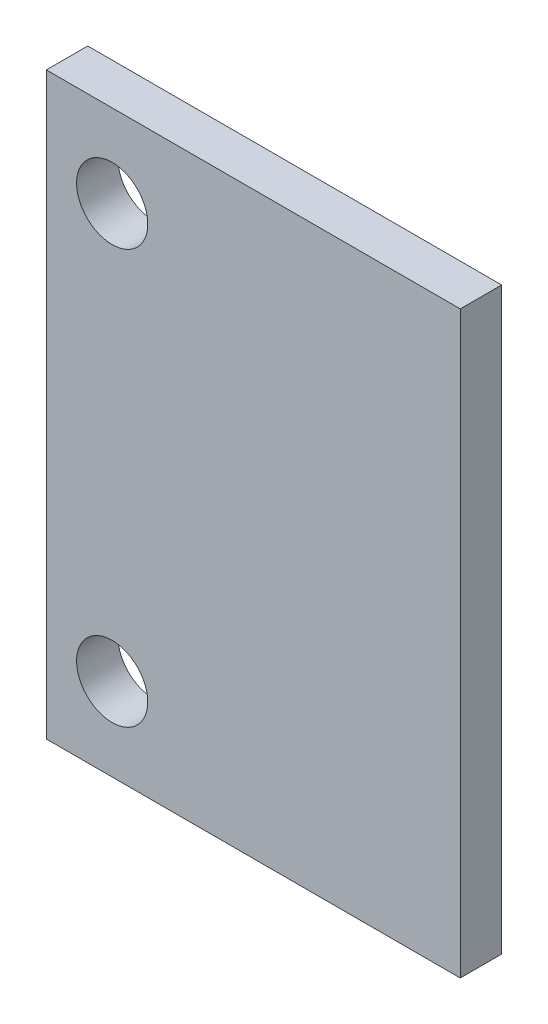
ISO-10303-21;
HEADER;
FILE_DESCRIPTION(('STEP AP214'),'2;1');
FILE_NAME('part.step','',(''),(''),'','','');
FILE_SCHEMA(('AUTOMOTIVE_DESIGN { 1 0 10303 214 1 1 1 1 }'));
ENDSEC;
DATA;
#1=APPLICATION_CONTEXT('core data for automotive mechanical design processes');
#2=APPLICATION_PROTOCOL_DEFINITION('international standard','automotive_design',2000,#1);
#3=PRODUCT_CONTEXT('',#1,'mechanical');
#4=PRODUCT('Part','Part','',(#3));
#5=PRODUCT_RELATED_PRODUCT_CATEGORY('part','',(#4));
#6=PRODUCT_DEFINITION_FORMATION('','',#4);
#7=PRODUCT_DEFINITION_CONTEXT('part definition',#1,'design');
#8=PRODUCT_DEFINITION('design','',#6,#7);
#9=PRODUCT_DEFINITION_SHAPE('','',#8);
#10=(LENGTH_UNIT() NAMED_UNIT(*) SI_UNIT(.MILLI.,.METRE.));
#11=(NAMED_UNIT(*) PLANE_ANGLE_UNIT() SI_UNIT($,.RADIAN.));
#12=(NAMED_UNIT(*) SI_UNIT($,.STERADIAN.) SOLID_ANGLE_UNIT());
#13=UNCERTAINTY_MEASURE_WITH_UNIT(LENGTH_MEASURE(1.E-05),#10,'distance_accuracy_value','');
#14=(GEOMETRIC_REPRESENTATION_CONTEXT(3) GLOBAL_UNCERTAINTY_ASSIGNED_CONTEXT((#13)) GLOBAL_UNIT_ASSIGNED_CONTEXT((#10,
#11,#12)) REPRESENTATION_CONTEXT('',''));
#15=CARTESIAN_POINT('',(0.,0.,0.));
#16=DIRECTION('',(0.,0.,1.));
#17=DIRECTION('',(1.,0.,0.));
#18=AXIS2_PLACEMENT_3D('',#15,#16,#17);
#19=CARTESIAN_POINT('',(0.,0.,0.635));
#20=DIRECTION('',(0.,0.,-1.));
#21=DIRECTION('',(-1.,0.,0.));
#22=AXIS2_PLACEMENT_3D('',#19,#20,#21);
#23=PLANE('',#22);
#24=DIRECTION('',(0.,1.,0.));
#25=VECTOR('',#24,1.);
#26=CARTESIAN_POINT('',(6.35,-8.89,0.635));
#27=LINE('',#26,#25);
#28=CARTESIAN_POINT('',(6.35,-8.89,0.635));
#29=VERTEX_POINT('',#28);
#30=CARTESIAN_POINT('',(6.35,8.89,0.635));
#31=VERTEX_POINT('',#30);
#32=EDGE_CURVE('E85',#29,#31,#27,.T.);
#33=ORIENTED_EDGE('',*,*,#32,.T.);
#34=DIRECTION('',(-1.,0.,0.));
#35=VECTOR('',#34,1.);
#36=CARTESIAN_POINT('',(-6.35,8.89,0.635));
#37=LINE('',#36,#35);
#38=CARTESIAN_POINT('',(-6.35,8.89,0.635));
#39=VERTEX_POINT('',#38);
#40=EDGE_CURVE('E80',#31,#39,#37,.T.);
#41=ORIENTED_EDGE('',*,*,#40,.T.);
#42=DIRECTION('',(0.,-1.,0.));
#43=VECTOR('',#42,1.);
#44=CARTESIAN_POINT('',(-6.35,-8.89,0.635));
#45=LINE('',#44,#43);
#46=CARTESIAN_POINT('',(-6.35,-8.89,0.635));
#47=VERTEX_POINT('',#46);
#48=EDGE_CURVE('E83',#39,#47,#45,.T.);
#49=ORIENTED_EDGE('',*,*,#48,.T.);
#50=DIRECTION('',(1.,0.,0.));
#51=VECTOR('',#50,1.);
#52=CARTESIAN_POINT('',(-6.35,-8.89,0.635));
#53=LINE('',#52,#51);
#54=EDGE_CURVE('E50',#47,#29,#53,.T.);
#55=ORIENTED_EDGE('',*,*,#54,.T.);
#56=EDGE_LOOP('',(#33,#41,#49,#55));
#57=FACE_BOUND('',#56,.T.);
#58=CARTESIAN_POINT('',(-4.330703088005,6.35,0.635));
#59=DIRECTION('',(0.,0.,1.));
#60=DIRECTION('',(1.,0.,0.));
#61=AXIS2_PLACEMENT_3D('',#58,#59,#60);
#62=CIRCLE('',#61,1.0922);
#63=CARTESIAN_POINT('',(-3.238503088005,6.35,0.635));
#64=VERTEX_POINT('',#63);
#65=EDGE_CURVE('E100',#64,#64,#62,.T.);
#66=ORIENTED_EDGE('',*,*,#65,.F.);
#67=EDGE_LOOP('',(#66));
#68=FACE_BOUND('',#67,.T.);
#69=CARTESIAN_POINT('',(-4.330703088005,-6.35,0.635));
#70=DIRECTION('',(0.,0.,1.));
#71=DIRECTION('',(1.,0.,0.));
#72=AXIS2_PLACEMENT_3D('',#69,#70,#71);
#73=CIRCLE('',#72,1.0922);
#74=CARTESIAN_POINT('',(-3.238503088005,-6.35,0.635));
#75=VERTEX_POINT('',#74);
#76=EDGE_CURVE('E115',#75,#75,#73,.T.);
#77=ORIENTED_EDGE('',*,*,#76,.F.);
#78=EDGE_LOOP('',(#77));
#79=FACE_BOUND('',#78,.T.);
#80=ADVANCED_FACE('F33',(#57,#68,#79),#23,.F.);
#81=CARTESIAN_POINT('',(0.,0.,-0.635));
#82=DIRECTION('',(0.,0.,-1.));
#83=DIRECTION('',(-1.,0.,0.));
#84=AXIS2_PLACEMENT_3D('',#81,#82,#83);
#85=PLANE('',#84);
#86=CARTESIAN_POINT('',(-4.330703088005,6.35,-0.635));
#87=DIRECTION('',(0.,0.,1.));
#88=DIRECTION('',(1.,0.,0.));
#89=AXIS2_PLACEMENT_3D('',#86,#87,#88);
#90=CIRCLE('',#89,1.0922);
#91=CARTESIAN_POINT('',(-3.238503088005,6.35,-0.635));
#92=VERTEX_POINT('',#91);
#93=EDGE_CURVE('E112',#92,#92,#90,.T.);
#94=ORIENTED_EDGE('',*,*,#93,.T.);
#95=EDGE_LOOP('',(#94));
#96=FACE_BOUND('',#95,.T.);
#97=DIRECTION('',(0.,1.,0.));
#98=VECTOR('',#97,1.);
#99=CARTESIAN_POINT('',(6.35,-8.89,-0.635));
#100=LINE('',#99,#98);
#101=CARTESIAN_POINT('',(6.35,-8.89,-0.635));
#102=VERTEX_POINT('',#101);
#103=CARTESIAN_POINT('',(6.35,8.89,-0.635));
#104=VERTEX_POINT('',#103);
#105=EDGE_CURVE('E97',#102,#104,#100,.T.);
#106=ORIENTED_EDGE('',*,*,#105,.F.);
#107=DIRECTION('',(1.,0.,0.));
#108=VECTOR('',#107,1.);
#109=CARTESIAN_POINT('',(-6.35,-8.89,-0.635));
#110=LINE('',#109,#108);
#111=CARTESIAN_POINT('',(-6.35,-8.89,-0.635));
#112=VERTEX_POINT('',#111);
#113=EDGE_CURVE('E73',#112,#102,#110,.T.);
#114=ORIENTED_EDGE('',*,*,#113,.F.);
#115=DIRECTION('',(0.,-1.,0.));
#116=VECTOR('',#115,1.);
#117=CARTESIAN_POINT('',(-6.35,-8.89,-0.635));
#118=LINE('',#117,#116);
#119=CARTESIAN_POINT('',(-6.35,8.89,-0.635));
#120=VERTEX_POINT('',#119);
#121=EDGE_CURVE('E67',#120,#112,#118,.T.);
#122=ORIENTED_EDGE('',*,*,#121,.F.);
#123=DIRECTION('',(-1.,0.,0.));
#124=VECTOR('',#123,1.);
#125=CARTESIAN_POINT('',(-6.35,8.89,-0.635));
#126=LINE('',#125,#124);
#127=EDGE_CURVE('E89',#104,#120,#126,.T.);
#128=ORIENTED_EDGE('',*,*,#127,.F.);
#129=EDGE_LOOP('',(#106,#114,#122,#128));
#130=FACE_BOUND('',#129,.T.);
#131=CARTESIAN_POINT('',(-4.330703088005,-6.35,-0.635));
#132=DIRECTION('',(0.,0.,1.));
#133=DIRECTION('',(1.,0.,0.));
#134=AXIS2_PLACEMENT_3D('',#131,#132,#133);
#135=CIRCLE('',#134,1.0922);
#136=CARTESIAN_POINT('',(-3.238503088005,-6.35,-0.635));
#137=VERTEX_POINT('',#136);
#138=EDGE_CURVE('E118',#137,#137,#135,.T.);
#139=ORIENTED_EDGE('',*,*,#138,.T.);
#140=EDGE_LOOP('',(#139));
#141=FACE_BOUND('',#140,.T.);
#142=ADVANCED_FACE('F108',(#96,#130,#141),#85,.T.);
#143=CARTESIAN_POINT('',(6.35,-8.89,0.635));
#144=DIRECTION('',(-1.,0.,0.));
#145=DIRECTION('',(0.,0.,1.));
#146=AXIS2_PLACEMENT_3D('',#143,#144,#145);
#147=PLANE('',#146);
#148=ORIENTED_EDGE('',*,*,#105,.T.);
#149=DIRECTION('',(0.,0.,-1.));
#150=VECTOR('',#149,1.);
#151=CARTESIAN_POINT('',(6.35,8.89,0.635));
#152=LINE('',#151,#150);
#153=EDGE_CURVE('E11',#31,#104,#152,.T.);
#154=ORIENTED_EDGE('',*,*,#153,.F.);
#155=ORIENTED_EDGE('',*,*,#32,.F.);
#156=DIRECTION('',(0.,0.,-1.));
#157=VECTOR('',#156,1.);
#158=CARTESIAN_POINT('',(6.35,-8.89,0.635));
#159=LINE('',#158,#157);
#160=EDGE_CURVE('E93',#29,#102,#159,.T.);
#161=ORIENTED_EDGE('',*,*,#160,.T.);
#162=EDGE_LOOP('',(#148,#154,#155,#161));
#163=FACE_BOUND('',#162,.T.);
#164=ADVANCED_FACE('F35',(#163),#147,.F.);
#165=CARTESIAN_POINT('',(-6.35,8.89,0.635));
#166=DIRECTION('',(0.,-1.,0.));
#167=DIRECTION('',(1.,0.,0.));
#168=AXIS2_PLACEMENT_3D('',#165,#166,#167);
#169=PLANE('',#168);
#170=ORIENTED_EDGE('',*,*,#127,.T.);
#171=DIRECTION('',(0.,0.,-1.));
#172=VECTOR('',#171,1.);
#173=CARTESIAN_POINT('',(-6.35,8.89,0.635));
#174=LINE('',#173,#172);
#175=EDGE_CURVE('E42',#39,#120,#174,.T.);
#176=ORIENTED_EDGE('',*,*,#175,.F.);
#177=ORIENTED_EDGE('',*,*,#40,.F.);
#178=ORIENTED_EDGE('',*,*,#153,.T.);
#179=EDGE_LOOP('',(#170,#176,#177,#178));
#180=FACE_BOUND('',#179,.T.);
#181=ADVANCED_FACE('F88',(#180),#169,.F.);
#182=CARTESIAN_POINT('',(-6.35,-8.89,0.635));
#183=DIRECTION('',(1.,0.,0.));
#184=DIRECTION('',(0.,0.,-1.));
#185=AXIS2_PLACEMENT_3D('',#182,#183,#184);
#186=PLANE('',#185);
#187=ORIENTED_EDGE('',*,*,#121,.T.);
#188=DIRECTION('',(0.,0.,-1.));
#189=VECTOR('',#188,1.);
#190=CARTESIAN_POINT('',(-6.35,-8.89,0.635));
#191=LINE('',#190,#189);
#192=EDGE_CURVE('E90',#47,#112,#191,.T.);
#193=ORIENTED_EDGE('',*,*,#192,.F.);
#194=ORIENTED_EDGE('',*,*,#48,.F.);
#195=ORIENTED_EDGE('',*,*,#175,.T.);
#196=EDGE_LOOP('',(#187,#193,#194,#195));
#197=FACE_BOUND('',#196,.T.);
#198=ADVANCED_FACE('F91',(#197),#186,.F.);
#199=CARTESIAN_POINT('',(-6.35,-8.89,0.635));
#200=DIRECTION('',(0.,1.,0.));
#201=DIRECTION('',(-1.,0.,0.));
#202=AXIS2_PLACEMENT_3D('',#199,#200,#201);
#203=PLANE('',#202);
#204=ORIENTED_EDGE('',*,*,#113,.T.);
#205=ORIENTED_EDGE('',*,*,#160,.F.);
#206=ORIENTED_EDGE('',*,*,#54,.F.);
#207=ORIENTED_EDGE('',*,*,#192,.T.);
#208=EDGE_LOOP('',(#204,#205,#206,#207));
#209=FACE_BOUND('',#208,.T.);
#210=ADVANCED_FACE('F105',(#209),#203,.F.);
#211=CARTESIAN_POINT('',(-4.330703088005,6.35,0.635));
#212=DIRECTION('',(0.,0.,-1.));
#213=DIRECTION('',(-1.,0.,0.));
#214=AXIS2_PLACEMENT_3D('',#211,#212,#213);
#215=CYLINDRICAL_SURFACE('',#214,1.0922);
#216=ORIENTED_EDGE('',*,*,#65,.T.);
#217=EDGE_LOOP('',(#216));
#218=FACE_BOUND('',#217,.T.);
#219=ORIENTED_EDGE('',*,*,#93,.F.);
#220=EDGE_LOOP('',(#219));
#221=FACE_BOUND('',#220,.T.);
#222=ADVANCED_FACE('F135',(#218,#221),#215,.F.);
#223=CARTESIAN_POINT('',(-4.330703088005,-6.35,0.635));
#224=DIRECTION('',(0.,0.,-1.));
#225=DIRECTION('',(-1.,0.,0.));
#226=AXIS2_PLACEMENT_3D('',#223,#224,#225);
#227=CYLINDRICAL_SURFACE('',#226,1.0922);
#228=ORIENTED_EDGE('',*,*,#76,.T.);
#229=EDGE_LOOP('',(#228));
#230=FACE_BOUND('',#229,.T.);
#231=ORIENTED_EDGE('',*,*,#138,.F.);
#232=EDGE_LOOP('',(#231));
#233=FACE_BOUND('',#232,.T.);
#234=ADVANCED_FACE('F124',(#230,#233),#227,.F.);
#235=CLOSED_SHELL('',(#80,#142,#164,#181,#198,#210,#222,#234));
#236=MANIFOLD_SOLID_BREP('B2',#235);
#237=ADVANCED_BREP_SHAPE_REPRESENTATION('',(#18,#236),#14);
#238=SHAPE_DEFINITION_REPRESENTATION(#9,#237);
ENDSEC;
END-ISO-10303-21;
